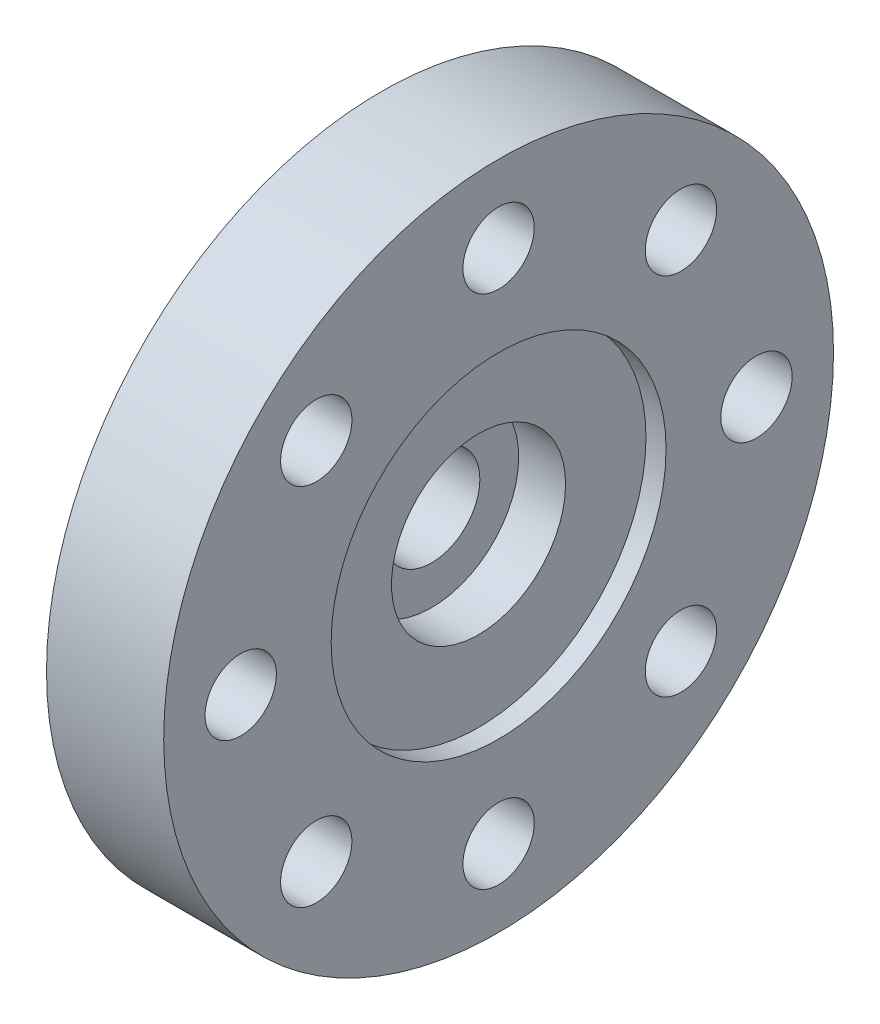
ISO-10303-21;
HEADER;
FILE_DESCRIPTION(('STEP AP214'),'2;1');
FILE_NAME('part.step','',(''),(''),'','','');
FILE_SCHEMA(('AUTOMOTIVE_DESIGN { 1 0 10303 214 1 1 1 1 }'));
ENDSEC;
DATA;
#1=APPLICATION_CONTEXT('core data for automotive mechanical design processes');
#2=APPLICATION_PROTOCOL_DEFINITION('international standard','automotive_design',2000,#1);
#3=PRODUCT_CONTEXT('',#1,'mechanical');
#4=PRODUCT('Part','Part','',(#3));
#5=PRODUCT_RELATED_PRODUCT_CATEGORY('part','',(#4));
#6=PRODUCT_DEFINITION_FORMATION('','',#4);
#7=PRODUCT_DEFINITION_CONTEXT('part definition',#1,'design');
#8=PRODUCT_DEFINITION('design','',#6,#7);
#9=PRODUCT_DEFINITION_SHAPE('','',#8);
#10=(LENGTH_UNIT() NAMED_UNIT(*) SI_UNIT(.MILLI.,.METRE.));
#11=(NAMED_UNIT(*) PLANE_ANGLE_UNIT() SI_UNIT($,.RADIAN.));
#12=(NAMED_UNIT(*) SI_UNIT($,.STERADIAN.) SOLID_ANGLE_UNIT());
#13=UNCERTAINTY_MEASURE_WITH_UNIT(LENGTH_MEASURE(1.E-05),#10,'distance_accuracy_value','');
#14=(GEOMETRIC_REPRESENTATION_CONTEXT(3) GLOBAL_UNCERTAINTY_ASSIGNED_CONTEXT((#13)) GLOBAL_UNIT_ASSIGNED_CONTEXT((#10,
#11,#12)) REPRESENTATION_CONTEXT('',''));
#15=CARTESIAN_POINT('',(0.,0.,0.));
#16=DIRECTION('',(0.,0.,1.));
#17=DIRECTION('',(1.,0.,0.));
#18=AXIS2_PLACEMENT_3D('',#15,#16,#17);
#19=CARTESIAN_POINT('',(4.445,0.,0.));
#20=DIRECTION('',(1.,0.,0.));
#21=DIRECTION('',(0.,0.,-1.));
#22=AXIS2_PLACEMENT_3D('',#19,#20,#21);
#23=PLANE('',#22);
#24=CARTESIAN_POINT('',(4.445,0.,0.));
#25=DIRECTION('',(1.,0.,0.));
#26=DIRECTION('',(0.,0.,-1.));
#27=AXIS2_PLACEMENT_3D('',#24,#25,#26);
#28=CIRCLE('',#27,6.35);
#29=CARTESIAN_POINT('',(4.445,0.,-6.35));
#30=VERTEX_POINT('',#29);
#31=EDGE_CURVE('E91',#30,#30,#28,.T.);
#32=ORIENTED_EDGE('',*,*,#31,.F.);
#33=EDGE_LOOP('',(#32));
#34=FACE_BOUND('',#33,.T.);
#35=CARTESIAN_POINT('',(4.445,-4.16903844779881E-13,9.77899999999958));
#36=DIRECTION('',(1.,0.,0.));
#37=DIRECTION('',(0.,0.,-1.));
#38=AXIS2_PLACEMENT_3D('',#35,#36,#37);
#39=CIRCLE('',#38,1.35255000000062);
#40=CARTESIAN_POINT('',(4.445,-4.16903844779881E-13,8.42644999999897));
#41=VERTEX_POINT('',#40);
#42=EDGE_CURVE('E76',#41,#41,#39,.T.);
#43=ORIENTED_EDGE('',*,*,#42,.F.);
#44=EDGE_LOOP('',(#43));
#45=FACE_BOUND('',#44,.T.);
#46=CARTESIAN_POINT('',(4.445,-9.779,-8.31770244680021E-13));
#47=DIRECTION('',(1.,0.,0.));
#48=DIRECTION('',(0.,0.,-1.));
#49=AXIS2_PLACEMENT_3D('',#46,#47,#48);
#50=CIRCLE('',#49,1.35255000000086);
#51=CARTESIAN_POINT('',(4.445,-9.779,-1.35255000000169));
#52=VERTEX_POINT('',#51);
#53=EDGE_CURVE('E64',#52,#52,#50,.T.);
#54=ORIENTED_EDGE('',*,*,#53,.F.);
#55=EDGE_LOOP('',(#54));
#56=FACE_BOUND('',#55,.T.);
#57=CARTESIAN_POINT('',(4.445,4.15706262674995E-13,-9.77900000000041));
#58=DIRECTION('',(1.,0.,0.));
#59=DIRECTION('',(0.,0.,-1.));
#60=AXIS2_PLACEMENT_3D('',#57,#58,#59);
#61=CIRCLE('',#60,1.35255000000031);
#62=CARTESIAN_POINT('',(4.445,4.15706262674995E-13,-11.1315500000007));
#63=VERTEX_POINT('',#62);
#64=EDGE_CURVE('E52',#63,#63,#61,.T.);
#65=ORIENTED_EDGE('',*,*,#64,.F.);
#66=EDGE_LOOP('',(#65));
#67=FACE_BOUND('',#66,.T.);
#68=CARTESIAN_POINT('',(4.445,9.779,0.));
#69=DIRECTION('',(1.,0.,0.));
#70=DIRECTION('',(0.,0.,-1.));
#71=AXIS2_PLACEMENT_3D('',#68,#69,#70);
#72=CIRCLE('',#71,1.35255);
#73=CARTESIAN_POINT('',(4.445,9.779,-1.35255));
#74=VERTEX_POINT('',#73);
#75=EDGE_CURVE('E41',#74,#74,#72,.T.);
#76=ORIENTED_EDGE('',*,*,#75,.F.);
#77=EDGE_LOOP('',(#76));
#78=FACE_BOUND('',#77,.T.);
#79=CARTESIAN_POINT('',(4.445,0.,0.));
#80=DIRECTION('',(1.,0.,0.));
#81=DIRECTION('',(0.,0.,-1.));
#82=AXIS2_PLACEMENT_3D('',#79,#80,#81);
#83=CIRCLE('',#82,12.7);
#84=CARTESIAN_POINT('',(4.445,0.,-12.7));
#85=VERTEX_POINT('',#84);
#86=EDGE_CURVE('E10',#85,#85,#83,.T.);
#87=ORIENTED_EDGE('',*,*,#86,.T.);
#88=EDGE_LOOP('',(#87));
#89=FACE_BOUND('',#88,.T.);
#90=CARTESIAN_POINT('',(4.445,6.91479721322354,-6.91479721322337));
#91=DIRECTION('',(1.,0.,0.));
#92=DIRECTION('',(0.,0.,-1.));
#93=AXIS2_PLACEMENT_3D('',#90,#91,#92);
#94=CIRCLE('',#93,1.35255000000005);
#95=CARTESIAN_POINT('',(4.445,6.91479721322354,-8.26734721322342));
#96=VERTEX_POINT('',#95);
#97=EDGE_CURVE('E46',#96,#96,#94,.T.);
#98=ORIENTED_EDGE('',*,*,#97,.F.);
#99=EDGE_LOOP('',(#98));
#100=FACE_BOUND('',#99,.T.);
#101=CARTESIAN_POINT('',(4.445,-6.91479721322295,-6.91479721322396));
#102=DIRECTION('',(1.,0.,0.));
#103=DIRECTION('',(0.,0.,-1.));
#104=AXIS2_PLACEMENT_3D('',#101,#102,#103);
#105=CIRCLE('',#104,1.35255000000064);
#106=CARTESIAN_POINT('',(4.445,-6.91479721322295,-8.2673472132246));
#107=VERTEX_POINT('',#106);
#108=EDGE_CURVE('E58',#107,#107,#105,.T.);
#109=ORIENTED_EDGE('',*,*,#108,.F.);
#110=EDGE_LOOP('',(#109));
#111=FACE_BOUND('',#110,.T.);
#112=CARTESIAN_POINT('',(4.445,-6.91479721322354,6.91479721322254));
#113=DIRECTION('',(1.,0.,0.));
#114=DIRECTION('',(0.,0.,-1.));
#115=AXIS2_PLACEMENT_3D('',#112,#113,#114);
#116=CIRCLE('',#115,1.35255000000085);
#117=CARTESIAN_POINT('',(4.445,-6.91479721322354,5.56224721322169));
#118=VERTEX_POINT('',#117);
#119=EDGE_CURVE('E70',#118,#118,#116,.T.);
#120=ORIENTED_EDGE('',*,*,#119,.F.);
#121=EDGE_LOOP('',(#120));
#122=FACE_BOUND('',#121,.T.);
#123=CARTESIAN_POINT('',(4.445,6.91479721322295,6.91479721322313));
#124=DIRECTION('',(1.,0.,0.));
#125=DIRECTION('',(0.,0.,-1.));
#126=AXIS2_PLACEMENT_3D('',#123,#124,#125);
#127=CIRCLE('',#126,1.35255000000032);
#128=CARTESIAN_POINT('',(4.445,6.91479721322295,5.56224721322281));
#129=VERTEX_POINT('',#128);
#130=EDGE_CURVE('E82',#129,#129,#127,.T.);
#131=ORIENTED_EDGE('',*,*,#130,.F.);
#132=EDGE_LOOP('',(#131));
#133=FACE_BOUND('',#132,.T.);
#134=ADVANCED_FACE('F30',(#34,#45,#56,#67,#78,#89,#100,#111,#122,#133),#23,.T.);
#135=CARTESIAN_POINT('',(0.,0.,0.));
#136=DIRECTION('',(1.,0.,0.));
#137=DIRECTION('',(0.,0.,-1.));
#138=AXIS2_PLACEMENT_3D('',#135,#136,#137);
#139=PLANE('',#138);
#140=CARTESIAN_POINT('',(0.,0.,0.));
#141=DIRECTION('',(1.,0.,0.));
#142=DIRECTION('',(0.,0.,-1.));
#143=AXIS2_PLACEMENT_3D('',#140,#141,#142);
#144=CIRCLE('',#143,1.8288);
#145=CARTESIAN_POINT('',(0.,0.,-1.8288));
#146=VERTEX_POINT('',#145);
#147=EDGE_CURVE('E100',#146,#146,#144,.T.);
#148=ORIENTED_EDGE('',*,*,#147,.T.);
#149=EDGE_LOOP('',(#148));
#150=FACE_BOUND('',#149,.T.);
#151=CARTESIAN_POINT('',(0.,-4.16903844779881E-13,9.77899999999958));
#152=DIRECTION('',(1.,0.,0.));
#153=DIRECTION('',(0.,0.,-1.));
#154=AXIS2_PLACEMENT_3D('',#151,#152,#153);
#155=CIRCLE('',#154,1.35255000000062);
#156=CARTESIAN_POINT('',(0.,-4.16903844779881E-13,8.42644999999897));
#157=VERTEX_POINT('',#156);
#158=EDGE_CURVE('E79',#157,#157,#155,.T.);
#159=ORIENTED_EDGE('',*,*,#158,.T.);
#160=EDGE_LOOP('',(#159));
#161=FACE_BOUND('',#160,.T.);
#162=CARTESIAN_POINT('',(0.,-9.779,-8.31770244680021E-13));
#163=DIRECTION('',(1.,0.,0.));
#164=DIRECTION('',(0.,0.,-1.));
#165=AXIS2_PLACEMENT_3D('',#162,#163,#164);
#166=CIRCLE('',#165,1.35255000000086);
#167=CARTESIAN_POINT('',(0.,-9.779,-1.35255000000169));
#168=VERTEX_POINT('',#167);
#169=EDGE_CURVE('E67',#168,#168,#166,.T.);
#170=ORIENTED_EDGE('',*,*,#169,.T.);
#171=EDGE_LOOP('',(#170));
#172=FACE_BOUND('',#171,.T.);
#173=CARTESIAN_POINT('',(0.,4.15706262674995E-13,-9.77900000000041));
#174=DIRECTION('',(1.,0.,0.));
#175=DIRECTION('',(0.,0.,-1.));
#176=AXIS2_PLACEMENT_3D('',#173,#174,#175);
#177=CIRCLE('',#176,1.35255000000031);
#178=CARTESIAN_POINT('',(0.,4.15706262674995E-13,-11.1315500000007));
#179=VERTEX_POINT('',#178);
#180=EDGE_CURVE('E55',#179,#179,#177,.T.);
#181=ORIENTED_EDGE('',*,*,#180,.T.);
#182=EDGE_LOOP('',(#181));
#183=FACE_BOUND('',#182,.T.);
#184=CARTESIAN_POINT('',(0.,9.779,0.));
#185=DIRECTION('',(1.,0.,0.));
#186=DIRECTION('',(0.,0.,-1.));
#187=AXIS2_PLACEMENT_3D('',#184,#185,#186);
#188=CIRCLE('',#187,1.35255);
#189=CARTESIAN_POINT('',(0.,9.779,-1.35255));
#190=VERTEX_POINT('',#189);
#191=EDGE_CURVE('E43',#190,#190,#188,.T.);
#192=ORIENTED_EDGE('',*,*,#191,.T.);
#193=EDGE_LOOP('',(#192));
#194=FACE_BOUND('',#193,.T.);
#195=CARTESIAN_POINT('',(0.,0.,0.));
#196=DIRECTION('',(1.,0.,0.));
#197=DIRECTION('',(0.,0.,-1.));
#198=AXIS2_PLACEMENT_3D('',#195,#196,#197);
#199=CIRCLE('',#198,12.7);
#200=CARTESIAN_POINT('',(0.,0.,-12.7));
#201=VERTEX_POINT('',#200);
#202=EDGE_CURVE('E34',#201,#201,#199,.T.);
#203=ORIENTED_EDGE('',*,*,#202,.F.);
#204=EDGE_LOOP('',(#203));
#205=FACE_BOUND('',#204,.T.);
#206=CARTESIAN_POINT('',(0.,6.91479721322354,-6.91479721322337));
#207=DIRECTION('',(1.,0.,0.));
#208=DIRECTION('',(0.,0.,-1.));
#209=AXIS2_PLACEMENT_3D('',#206,#207,#208);
#210=CIRCLE('',#209,1.35255000000005);
#211=CARTESIAN_POINT('',(0.,6.91479721322354,-8.26734721322342));
#212=VERTEX_POINT('',#211);
#213=EDGE_CURVE('E49',#212,#212,#210,.T.);
#214=ORIENTED_EDGE('',*,*,#213,.T.);
#215=EDGE_LOOP('',(#214));
#216=FACE_BOUND('',#215,.T.);
#217=CARTESIAN_POINT('',(0.,-6.91479721322295,-6.91479721322396));
#218=DIRECTION('',(1.,0.,0.));
#219=DIRECTION('',(0.,0.,-1.));
#220=AXIS2_PLACEMENT_3D('',#217,#218,#219);
#221=CIRCLE('',#220,1.35255000000064);
#222=CARTESIAN_POINT('',(0.,-6.91479721322295,-8.2673472132246));
#223=VERTEX_POINT('',#222);
#224=EDGE_CURVE('E61',#223,#223,#221,.T.);
#225=ORIENTED_EDGE('',*,*,#224,.T.);
#226=EDGE_LOOP('',(#225));
#227=FACE_BOUND('',#226,.T.);
#228=CARTESIAN_POINT('',(0.,-6.91479721322354,6.91479721322254));
#229=DIRECTION('',(1.,0.,0.));
#230=DIRECTION('',(0.,0.,-1.));
#231=AXIS2_PLACEMENT_3D('',#228,#229,#230);
#232=CIRCLE('',#231,1.35255000000085);
#233=CARTESIAN_POINT('',(0.,-6.91479721322354,5.56224721322169));
#234=VERTEX_POINT('',#233);
#235=EDGE_CURVE('E73',#234,#234,#232,.T.);
#236=ORIENTED_EDGE('',*,*,#235,.T.);
#237=EDGE_LOOP('',(#236));
#238=FACE_BOUND('',#237,.T.);
#239=CARTESIAN_POINT('',(0.,6.91479721322295,6.91479721322313));
#240=DIRECTION('',(1.,0.,0.));
#241=DIRECTION('',(0.,0.,-1.));
#242=AXIS2_PLACEMENT_3D('',#239,#240,#241);
#243=CIRCLE('',#242,1.35255000000032);
#244=CARTESIAN_POINT('',(0.,6.91479721322295,5.56224721322281));
#245=VERTEX_POINT('',#244);
#246=EDGE_CURVE('E85',#245,#245,#243,.T.);
#247=ORIENTED_EDGE('',*,*,#246,.T.);
#248=EDGE_LOOP('',(#247));
#249=FACE_BOUND('',#248,.T.);
#250=ADVANCED_FACE('F109',(#150,#161,#172,#183,#194,#205,#216,#227,#238,#249),#139,.F.);
#251=CARTESIAN_POINT('',(4.445,0.,0.));
#252=DIRECTION('',(-1.,0.,0.));
#253=DIRECTION('',(0.,0.,1.));
#254=AXIS2_PLACEMENT_3D('',#251,#252,#253);
#255=CYLINDRICAL_SURFACE('',#254,12.7);
#256=ORIENTED_EDGE('',*,*,#86,.F.);
#257=EDGE_LOOP('',(#256));
#258=FACE_BOUND('',#257,.T.);
#259=ORIENTED_EDGE('',*,*,#202,.T.);
#260=EDGE_LOOP('',(#259));
#261=FACE_BOUND('',#260,.T.);
#262=ADVANCED_FACE('F32',(#258,#261),#255,.T.);
#263=CARTESIAN_POINT('',(4.445,9.779,0.));
#264=DIRECTION('',(-1.,0.,0.));
#265=DIRECTION('',(0.,0.,1.));
#266=AXIS2_PLACEMENT_3D('',#263,#264,#265);
#267=CYLINDRICAL_SURFACE('',#266,1.35255);
#268=ORIENTED_EDGE('',*,*,#75,.T.);
#269=EDGE_LOOP('',(#268));
#270=FACE_BOUND('',#269,.T.);
#271=ORIENTED_EDGE('',*,*,#191,.F.);
#272=EDGE_LOOP('',(#271));
#273=FACE_BOUND('',#272,.T.);
#274=ADVANCED_FACE('F172',(#270,#273),#267,.F.);
#275=CARTESIAN_POINT('',(4.445,6.91479721322354,-6.91479721322337));
#276=DIRECTION('',(-1.,0.,0.));
#277=DIRECTION('',(0.,0.,1.));
#278=AXIS2_PLACEMENT_3D('',#275,#276,#277);
#279=CYLINDRICAL_SURFACE('',#278,1.35255000000005);
#280=ORIENTED_EDGE('',*,*,#97,.T.);
#281=EDGE_LOOP('',(#280));
#282=FACE_BOUND('',#281,.T.);
#283=ORIENTED_EDGE('',*,*,#213,.F.);
#284=EDGE_LOOP('',(#283));
#285=FACE_BOUND('',#284,.T.);
#286=ADVANCED_FACE('F177',(#282,#285),#279,.F.);
#287=CARTESIAN_POINT('',(4.445,4.15706262674995E-13,-9.77900000000041));
#288=DIRECTION('',(-1.,0.,0.));
#289=DIRECTION('',(0.,0.,1.));
#290=AXIS2_PLACEMENT_3D('',#287,#288,#289);
#291=CYLINDRICAL_SURFACE('',#290,1.35255000000031);
#292=ORIENTED_EDGE('',*,*,#64,.T.);
#293=EDGE_LOOP('',(#292));
#294=FACE_BOUND('',#293,.T.);
#295=ORIENTED_EDGE('',*,*,#180,.F.);
#296=EDGE_LOOP('',(#295));
#297=FACE_BOUND('',#296,.T.);
#298=ADVANCED_FACE('F181',(#294,#297),#291,.F.);
#299=CARTESIAN_POINT('',(4.445,-6.91479721322295,-6.91479721322396));
#300=DIRECTION('',(-1.,0.,0.));
#301=DIRECTION('',(0.,0.,1.));
#302=AXIS2_PLACEMENT_3D('',#299,#300,#301);
#303=CYLINDRICAL_SURFACE('',#302,1.35255000000064);
#304=ORIENTED_EDGE('',*,*,#108,.T.);
#305=EDGE_LOOP('',(#304));
#306=FACE_BOUND('',#305,.T.);
#307=ORIENTED_EDGE('',*,*,#224,.F.);
#308=EDGE_LOOP('',(#307));
#309=FACE_BOUND('',#308,.T.);
#310=ADVANCED_FACE('F185',(#306,#309),#303,.F.);
#311=CARTESIAN_POINT('',(4.445,-9.779,-8.31770244680021E-13));
#312=DIRECTION('',(-1.,0.,0.));
#313=DIRECTION('',(0.,0.,1.));
#314=AXIS2_PLACEMENT_3D('',#311,#312,#313);
#315=CYLINDRICAL_SURFACE('',#314,1.35255000000086);
#316=ORIENTED_EDGE('',*,*,#53,.T.);
#317=EDGE_LOOP('',(#316));
#318=FACE_BOUND('',#317,.T.);
#319=ORIENTED_EDGE('',*,*,#169,.F.);
#320=EDGE_LOOP('',(#319));
#321=FACE_BOUND('',#320,.T.);
#322=ADVANCED_FACE('F189',(#318,#321),#315,.F.);
#323=CARTESIAN_POINT('',(4.445,-6.91479721322354,6.91479721322254));
#324=DIRECTION('',(-1.,0.,0.));
#325=DIRECTION('',(0.,0.,1.));
#326=AXIS2_PLACEMENT_3D('',#323,#324,#325);
#327=CYLINDRICAL_SURFACE('',#326,1.35255000000085);
#328=ORIENTED_EDGE('',*,*,#119,.T.);
#329=EDGE_LOOP('',(#328));
#330=FACE_BOUND('',#329,.T.);
#331=ORIENTED_EDGE('',*,*,#235,.F.);
#332=EDGE_LOOP('',(#331));
#333=FACE_BOUND('',#332,.T.);
#334=ADVANCED_FACE('F193',(#330,#333),#327,.F.);
#335=CARTESIAN_POINT('',(4.445,-4.16903844779881E-13,9.77899999999958));
#336=DIRECTION('',(-1.,0.,0.));
#337=DIRECTION('',(0.,0.,1.));
#338=AXIS2_PLACEMENT_3D('',#335,#336,#337);
#339=CYLINDRICAL_SURFACE('',#338,1.35255000000062);
#340=ORIENTED_EDGE('',*,*,#42,.T.);
#341=EDGE_LOOP('',(#340));
#342=FACE_BOUND('',#341,.T.);
#343=ORIENTED_EDGE('',*,*,#158,.F.);
#344=EDGE_LOOP('',(#343));
#345=FACE_BOUND('',#344,.T.);
#346=ADVANCED_FACE('F164',(#342,#345),#339,.F.);
#347=CARTESIAN_POINT('',(4.445,6.91479721322295,6.91479721322313));
#348=DIRECTION('',(-1.,0.,0.));
#349=DIRECTION('',(0.,0.,1.));
#350=AXIS2_PLACEMENT_3D('',#347,#348,#349);
#351=CYLINDRICAL_SURFACE('',#350,1.35255000000032);
#352=ORIENTED_EDGE('',*,*,#130,.T.);
#353=EDGE_LOOP('',(#352));
#354=FACE_BOUND('',#353,.T.);
#355=ORIENTED_EDGE('',*,*,#246,.F.);
#356=EDGE_LOOP('',(#355));
#357=FACE_BOUND('',#356,.T.);
#358=ADVANCED_FACE('F139',(#354,#357),#351,.F.);
#359=CARTESIAN_POINT('',(3.683,0.,0.));
#360=DIRECTION('',(1.,0.,0.));
#361=DIRECTION('',(0.,0.,-1.));
#362=AXIS2_PLACEMENT_3D('',#359,#360,#361);
#363=CYLINDRICAL_SURFACE('',#362,6.35);
#364=CARTESIAN_POINT('',(3.683,0.,0.));
#365=DIRECTION('',(1.,0.,0.));
#366=DIRECTION('',(0.,0.,-1.));
#367=AXIS2_PLACEMENT_3D('',#364,#365,#366);
#368=CIRCLE('',#367,6.35);
#369=CARTESIAN_POINT('',(3.683,0.,-6.35));
#370=VERTEX_POINT('',#369);
#371=EDGE_CURVE('E88',#370,#370,#368,.T.);
#372=ORIENTED_EDGE('',*,*,#371,.F.);
#373=EDGE_LOOP('',(#372));
#374=FACE_BOUND('',#373,.T.);
#375=ORIENTED_EDGE('',*,*,#31,.T.);
#376=EDGE_LOOP('',(#375));
#377=FACE_BOUND('',#376,.T.);
#378=ADVANCED_FACE('F133',(#374,#377),#363,.F.);
#379=CARTESIAN_POINT('',(3.683,0.,0.));
#380=DIRECTION('',(1.,0.,0.));
#381=DIRECTION('',(0.,0.,-1.));
#382=AXIS2_PLACEMENT_3D('',#379,#380,#381);
#383=PLANE('',#382);
#384=CARTESIAN_POINT('',(3.683,0.,0.));
#385=DIRECTION('',(1.,0.,0.));
#386=DIRECTION('',(0.,0.,-1.));
#387=AXIS2_PLACEMENT_3D('',#384,#385,#386);
#388=CIRCLE('',#387,3.302);
#389=CARTESIAN_POINT('',(3.683,0.,-3.302));
#390=VERTEX_POINT('',#389);
#391=EDGE_CURVE('E97',#390,#390,#388,.T.);
#392=ORIENTED_EDGE('',*,*,#391,.F.);
#393=EDGE_LOOP('',(#392));
#394=FACE_BOUND('',#393,.T.);
#395=ORIENTED_EDGE('',*,*,#371,.T.);
#396=EDGE_LOOP('',(#395));
#397=FACE_BOUND('',#396,.T.);
#398=ADVANCED_FACE('F127',(#394,#397),#383,.T.);
#399=CARTESIAN_POINT('',(1.905,0.,0.));
#400=DIRECTION('',(1.,0.,0.));
#401=DIRECTION('',(0.,0.,-1.));
#402=AXIS2_PLACEMENT_3D('',#399,#400,#401);
#403=CYLINDRICAL_SURFACE('',#402,3.302);
#404=CARTESIAN_POINT('',(1.905,0.,0.));
#405=DIRECTION('',(1.,0.,0.));
#406=DIRECTION('',(0.,0.,-1.));
#407=AXIS2_PLACEMENT_3D('',#404,#405,#406);
#408=CIRCLE('',#407,3.302);
#409=CARTESIAN_POINT('',(1.905,0.,-3.302));
#410=VERTEX_POINT('',#409);
#411=EDGE_CURVE('E94',#410,#410,#408,.T.);
#412=ORIENTED_EDGE('',*,*,#411,.F.);
#413=EDGE_LOOP('',(#412));
#414=FACE_BOUND('',#413,.T.);
#415=ORIENTED_EDGE('',*,*,#391,.T.);
#416=EDGE_LOOP('',(#415));
#417=FACE_BOUND('',#416,.T.);
#418=ADVANCED_FACE('F121',(#414,#417),#403,.F.);
#419=CARTESIAN_POINT('',(1.905,0.,0.));
#420=DIRECTION('',(1.,0.,0.));
#421=DIRECTION('',(0.,0.,-1.));
#422=AXIS2_PLACEMENT_3D('',#419,#420,#421);
#423=PLANE('',#422);
#424=CARTESIAN_POINT('',(1.905,0.,0.));
#425=DIRECTION('',(1.,0.,0.));
#426=DIRECTION('',(0.,0.,-1.));
#427=AXIS2_PLACEMENT_3D('',#424,#425,#426);
#428=CIRCLE('',#427,1.8288);
#429=CARTESIAN_POINT('',(1.905,0.,-1.8288));
#430=VERTEX_POINT('',#429);
#431=EDGE_CURVE('E103',#430,#430,#428,.T.);
#432=ORIENTED_EDGE('',*,*,#431,.F.);
#433=EDGE_LOOP('',(#432));
#434=FACE_BOUND('',#433,.T.);
#435=ORIENTED_EDGE('',*,*,#411,.T.);
#436=EDGE_LOOP('',(#435));
#437=FACE_BOUND('',#436,.T.);
#438=ADVANCED_FACE('F115',(#434,#437),#423,.T.);
#439=CARTESIAN_POINT('',(0.,0.,0.));
#440=DIRECTION('',(1.,0.,0.));
#441=DIRECTION('',(0.,0.,-1.));
#442=AXIS2_PLACEMENT_3D('',#439,#440,#441);
#443=CYLINDRICAL_SURFACE('',#442,1.8288);
#444=ORIENTED_EDGE('',*,*,#147,.F.);
#445=EDGE_LOOP('',(#444));
#446=FACE_BOUND('',#445,.T.);
#447=ORIENTED_EDGE('',*,*,#431,.T.);
#448=EDGE_LOOP('',(#447));
#449=FACE_BOUND('',#448,.T.);
#450=ADVANCED_FACE('F112',(#446,#449),#443,.F.);
#451=CLOSED_SHELL('',(#134,#250,#262,#274,#286,#298,#310,#322,#334,#346,#358,#378,#398,#418,
#438,#450));
#452=MANIFOLD_SOLID_BREP('B2',#451);
#453=ADVANCED_BREP_SHAPE_REPRESENTATION('',(#18,#452),#14);
#454=SHAPE_DEFINITION_REPRESENTATION(#9,#453);
ENDSEC;
END-ISO-10303-21;
